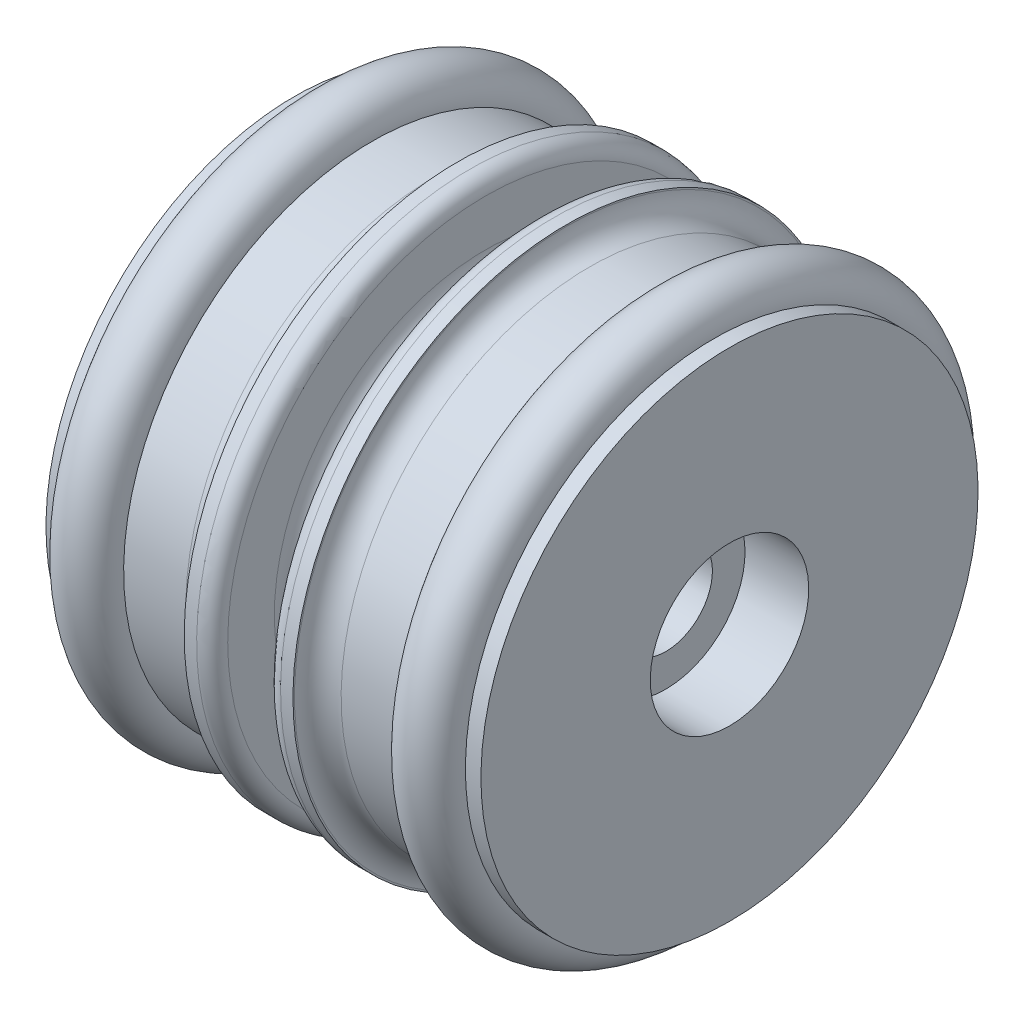
ISO-10303-21;
HEADER;
FILE_DESCRIPTION(('STEP AP214'),'2;1');
FILE_NAME('part.step','',(''),(''),'','','');
FILE_SCHEMA(('AUTOMOTIVE_DESIGN { 1 0 10303 214 1 1 1 1 }'));
ENDSEC;
DATA;
#1=APPLICATION_CONTEXT('core data for automotive mechanical design processes');
#2=APPLICATION_PROTOCOL_DEFINITION('international standard','automotive_design',2000,#1);
#3=PRODUCT_CONTEXT('',#1,'mechanical');
#4=PRODUCT('Part','Part','',(#3));
#5=PRODUCT_RELATED_PRODUCT_CATEGORY('part','',(#4));
#6=PRODUCT_DEFINITION_FORMATION('','',#4);
#7=PRODUCT_DEFINITION_CONTEXT('part definition',#1,'design');
#8=PRODUCT_DEFINITION('design','',#6,#7);
#9=PRODUCT_DEFINITION_SHAPE('','',#8);
#10=(LENGTH_UNIT() NAMED_UNIT(*) SI_UNIT(.MILLI.,.METRE.));
#11=(NAMED_UNIT(*) PLANE_ANGLE_UNIT() SI_UNIT($,.RADIAN.));
#12=(NAMED_UNIT(*) SI_UNIT($,.STERADIAN.) SOLID_ANGLE_UNIT());
#13=UNCERTAINTY_MEASURE_WITH_UNIT(LENGTH_MEASURE(1.E-05),#10,'distance_accuracy_value','');
#14=(GEOMETRIC_REPRESENTATION_CONTEXT(3) GLOBAL_UNCERTAINTY_ASSIGNED_CONTEXT((#13)) GLOBAL_UNIT_ASSIGNED_CONTEXT((#10,
#11,#12)) REPRESENTATION_CONTEXT('',''));
#15=CARTESIAN_POINT('',(0.,0.,0.));
#16=DIRECTION('',(0.,0.,1.));
#17=DIRECTION('',(1.,0.,0.));
#18=AXIS2_PLACEMENT_3D('',#15,#16,#17);
#19=CARTESIAN_POINT('',(25.3003912722596,0.,0.));
#20=DIRECTION('',(-1.,0.,0.));
#21=DIRECTION('',(0.,-1.,0.));
#22=AXIS2_PLACEMENT_3D('',#19,#20,#21);
#23=TOROIDAL_SURFACE('',#22,16.,1.95);
#24=CARTESIAN_POINT('',(25.3003912722596,-17.95,0.));
#25=VERTEX_POINT('',#24);
#26=VERTEX_LOOP('',#25);
#27=FACE_BOUND('',#26,.T.);
#28=ADVANCED_FACE('F40',(#27),#23,.T.);
#29=CLOSED_SHELL('',(#28));
#30=MANIFOLD_SOLID_BREP('B2',#29);
#31=CARTESIAN_POINT('',(3.30039127225962,0.,0.));
#32=DIRECTION('',(-1.,0.,0.));
#33=DIRECTION('',(0.,-1.,0.));
#34=AXIS2_PLACEMENT_3D('',#31,#32,#33);
#35=TOROIDAL_SURFACE('',#34,16.,1.95);
#36=CARTESIAN_POINT('',(3.30039127225962,-17.95,0.));
#37=VERTEX_POINT('',#36);
#38=VERTEX_LOOP('',#37);
#39=FACE_BOUND('',#38,.T.);
#40=ADVANCED_FACE('F62',(#39),#35,.T.);
#41=CLOSED_SHELL('',(#40));
#42=MANIFOLD_SOLID_BREP('B6',#41);
#43=CARTESIAN_POINT('',(4.40039127225962,5.1,0.));
#44=DIRECTION('',(1.,0.,0.));
#45=DIRECTION('',(0.,1.,0.));
#46=AXIS2_PLACEMENT_3D('',#43,#44,#45);
#47=PLANE('',#46);
#48=CARTESIAN_POINT('',(4.40039127225962,0.,0.));
#49=DIRECTION('',(-1.,0.,0.));
#50=DIRECTION('',(0.,-1.,0.));
#51=AXIS2_PLACEMENT_3D('',#48,#49,#50);
#52=CIRCLE('',#51,3.);
#53=CARTESIAN_POINT('',(4.40039127225962,-3.,0.));
#54=VERTEX_POINT('',#53);
#55=EDGE_CURVE('E61',#54,#54,#52,.T.);
#56=ORIENTED_EDGE('',*,*,#55,.F.);
#57=EDGE_LOOP('',(#56));
#58=FACE_BOUND('',#57,.T.);
#59=CARTESIAN_POINT('',(4.40039127225962,0.,0.));
#60=DIRECTION('',(-1.,0.,0.));
#61=DIRECTION('',(0.,-1.,0.));
#62=AXIS2_PLACEMENT_3D('',#59,#60,#61);
#63=CIRCLE('',#62,5.1);
#64=CARTESIAN_POINT('',(4.40039127225962,-5.1,0.));
#65=VERTEX_POINT('',#64);
#66=EDGE_CURVE('E159',#65,#65,#63,.T.);
#67=ORIENTED_EDGE('',*,*,#66,.T.);
#68=EDGE_LOOP('',(#67));
#69=FACE_BOUND('',#68,.T.);
#70=ADVANCED_FACE('F77',(#58,#69),#47,.F.);
#71=CARTESIAN_POINT('',(0.,0.,0.));
#72=DIRECTION('',(-1.,0.,0.));
#73=DIRECTION('',(0.,-1.,0.));
#74=AXIS2_PLACEMENT_3D('',#71,#72,#73);
#75=CYLINDRICAL_SURFACE('',#74,3.);
#76=CARTESIAN_POINT('',(24.2003912722596,0.,0.));
#77=DIRECTION('',(-1.,0.,0.));
#78=DIRECTION('',(0.,-1.,0.));
#79=AXIS2_PLACEMENT_3D('',#76,#77,#78);
#80=CIRCLE('',#79,3.);
#81=CARTESIAN_POINT('',(24.2003912722596,-3.,0.));
#82=VERTEX_POINT('',#81);
#83=EDGE_CURVE('E83',#82,#82,#80,.T.);
#84=ORIENTED_EDGE('',*,*,#83,.F.);
#85=EDGE_LOOP('',(#84));
#86=FACE_BOUND('',#85,.T.);
#87=ORIENTED_EDGE('',*,*,#55,.T.);
#88=EDGE_LOOP('',(#87));
#89=FACE_BOUND('',#88,.T.);
#90=ADVANCED_FACE('F304',(#86,#89),#75,.F.);
#91=CARTESIAN_POINT('',(24.2003912722596,3.,0.));
#92=DIRECTION('',(-1.,0.,0.));
#93=DIRECTION('',(0.,-1.,0.));
#94=AXIS2_PLACEMENT_3D('',#91,#92,#93);
#95=PLANE('',#94);
#96=CARTESIAN_POINT('',(24.2003912722596,0.,0.));
#97=DIRECTION('',(-1.,0.,0.));
#98=DIRECTION('',(0.,-1.,0.));
#99=AXIS2_PLACEMENT_3D('',#96,#97,#98);
#100=CIRCLE('',#99,5.1);
#101=CARTESIAN_POINT('',(24.2003912722596,-5.1,0.));
#102=VERTEX_POINT('',#101);
#103=EDGE_CURVE('E87',#102,#102,#100,.T.);
#104=ORIENTED_EDGE('',*,*,#103,.F.);
#105=EDGE_LOOP('',(#104));
#106=FACE_BOUND('',#105,.T.);
#107=ORIENTED_EDGE('',*,*,#83,.T.);
#108=EDGE_LOOP('',(#107));
#109=FACE_BOUND('',#108,.T.);
#110=ADVANCED_FACE('F299',(#106,#109),#95,.F.);
#111=CARTESIAN_POINT('',(0.,0.,0.));
#112=DIRECTION('',(-1.,0.,0.));
#113=DIRECTION('',(0.,-1.,0.));
#114=AXIS2_PLACEMENT_3D('',#111,#112,#113);
#115=CYLINDRICAL_SURFACE('',#114,5.1);
#116=CARTESIAN_POINT('',(28.3003912722596,0.,0.));
#117=DIRECTION('',(-1.,0.,0.));
#118=DIRECTION('',(0.,-1.,0.));
#119=AXIS2_PLACEMENT_3D('',#116,#117,#118);
#120=CIRCLE('',#119,5.1);
#121=CARTESIAN_POINT('',(28.3003912722596,-5.1,0.));
#122=VERTEX_POINT('',#121);
#123=EDGE_CURVE('E91',#122,#122,#120,.T.);
#124=ORIENTED_EDGE('',*,*,#123,.F.);
#125=EDGE_LOOP('',(#124));
#126=FACE_BOUND('',#125,.T.);
#127=ORIENTED_EDGE('',*,*,#103,.T.);
#128=EDGE_LOOP('',(#127));
#129=FACE_BOUND('',#128,.T.);
#130=ADVANCED_FACE('F293',(#126,#129),#115,.F.);
#131=CARTESIAN_POINT('',(28.3003912722596,16.,0.));
#132=DIRECTION('',(-1.,0.,0.));
#133=DIRECTION('',(0.,-1.,0.));
#134=AXIS2_PLACEMENT_3D('',#131,#132,#133);
#135=PLANE('',#134);
#136=CARTESIAN_POINT('',(28.3003912722596,0.,0.));
#137=DIRECTION('',(-1.,0.,0.));
#138=DIRECTION('',(0.,-1.,0.));
#139=AXIS2_PLACEMENT_3D('',#136,#137,#138);
#140=CIRCLE('',#139,16.);
#141=CARTESIAN_POINT('',(28.3003912722596,-16.,0.));
#142=VERTEX_POINT('',#141);
#143=EDGE_CURVE('E96',#142,#142,#140,.T.);
#144=ORIENTED_EDGE('',*,*,#143,.F.);
#145=EDGE_LOOP('',(#144));
#146=FACE_BOUND('',#145,.T.);
#147=ORIENTED_EDGE('',*,*,#123,.T.);
#148=EDGE_LOOP('',(#147));
#149=FACE_BOUND('',#148,.T.);
#150=ADVANCED_FACE('F287',(#146,#149),#135,.F.);
#151=CARTESIAN_POINT('',(0.,0.,0.));
#152=DIRECTION('',(-1.,0.,0.));
#153=DIRECTION('',(0.,-1.,0.));
#154=AXIS2_PLACEMENT_3D('',#151,#152,#153);
#155=CYLINDRICAL_SURFACE('',#154,16.);
#156=CARTESIAN_POINT('',(27.3003912722596,0.,0.));
#157=DIRECTION('',(-1.,0.,0.));
#158=DIRECTION('',(0.,-1.,0.));
#159=AXIS2_PLACEMENT_3D('',#156,#157,#158);
#160=CIRCLE('',#159,16.);
#161=CARTESIAN_POINT('',(27.3003912722596,-16.,0.));
#162=VERTEX_POINT('',#161);
#163=EDGE_CURVE('E99',#162,#162,#160,.T.);
#164=ORIENTED_EDGE('',*,*,#163,.F.);
#165=EDGE_LOOP('',(#164));
#166=FACE_BOUND('',#165,.T.);
#167=ORIENTED_EDGE('',*,*,#143,.T.);
#168=EDGE_LOOP('',(#167));
#169=FACE_BOUND('',#168,.T.);
#170=ADVANCED_FACE('F281',(#166,#169),#155,.T.);
#171=CARTESIAN_POINT('',(25.3003912722596,0.,0.));
#172=DIRECTION('',(-1.,0.,0.));
#173=DIRECTION('',(0.,-1.,0.));
#174=AXIS2_PLACEMENT_3D('',#171,#172,#173);
#175=TOROIDAL_SURFACE('',#174,16.,2.);
#176=CARTESIAN_POINT('',(23.3003912722596,0.,0.));
#177=DIRECTION('',(-1.,0.,0.));
#178=DIRECTION('',(0.,-1.,0.));
#179=AXIS2_PLACEMENT_3D('',#176,#177,#178);
#180=CIRCLE('',#179,16.);
#181=CARTESIAN_POINT('',(23.3003912722596,-16.,0.));
#182=VERTEX_POINT('',#181);
#183=EDGE_CURVE('E102',#182,#182,#180,.T.);
#184=ORIENTED_EDGE('',*,*,#183,.F.);
#185=EDGE_LOOP('',(#184));
#186=FACE_BOUND('',#185,.T.);
#187=ORIENTED_EDGE('',*,*,#163,.T.);
#188=EDGE_LOOP('',(#187));
#189=FACE_BOUND('',#188,.T.);
#190=ADVANCED_FACE('F275',(#186,#189),#175,.F.);
#191=CARTESIAN_POINT('',(0.,0.,0.));
#192=DIRECTION('',(-1.,0.,0.));
#193=DIRECTION('',(0.,-1.,0.));
#194=AXIS2_PLACEMENT_3D('',#191,#192,#193);
#195=CYLINDRICAL_SURFACE('',#194,16.);
#196=CARTESIAN_POINT('',(19.3003912722596,0.,0.));
#197=DIRECTION('',(-1.,0.,0.));
#198=DIRECTION('',(0.,-1.,0.));
#199=AXIS2_PLACEMENT_3D('',#196,#197,#198);
#200=CIRCLE('',#199,16.);
#201=CARTESIAN_POINT('',(19.3003912722596,-16.,0.));
#202=VERTEX_POINT('',#201);
#203=EDGE_CURVE('E105',#202,#202,#200,.T.);
#204=ORIENTED_EDGE('',*,*,#203,.F.);
#205=EDGE_LOOP('',(#204));
#206=FACE_BOUND('',#205,.T.);
#207=ORIENTED_EDGE('',*,*,#183,.T.);
#208=EDGE_LOOP('',(#207));
#209=FACE_BOUND('',#208,.T.);
#210=ADVANCED_FACE('F269',(#206,#209),#195,.T.);
#211=CARTESIAN_POINT('',(19.3003912722596,0.,0.));
#212=DIRECTION('',(-1.,0.,0.));
#213=DIRECTION('',(0.,-1.,0.));
#214=AXIS2_PLACEMENT_3D('',#211,#212,#213);
#215=TOROIDAL_SURFACE('',#214,17.5,1.5);
#216=CARTESIAN_POINT('',(17.8003912722596,0.,0.));
#217=DIRECTION('',(-1.,0.,0.));
#218=DIRECTION('',(0.,-1.,0.));
#219=AXIS2_PLACEMENT_3D('',#216,#217,#218);
#220=CIRCLE('',#219,17.5);
#221=CARTESIAN_POINT('',(17.8003912722596,-17.5,0.));
#222=VERTEX_POINT('',#221);
#223=EDGE_CURVE('E108',#222,#222,#220,.T.);
#224=ORIENTED_EDGE('',*,*,#223,.F.);
#225=EDGE_LOOP('',(#224));
#226=FACE_BOUND('',#225,.T.);
#227=ORIENTED_EDGE('',*,*,#203,.T.);
#228=EDGE_LOOP('',(#227));
#229=FACE_BOUND('',#228,.T.);
#230=ADVANCED_FACE('F263',(#226,#229),#215,.F.);
#231=CARTESIAN_POINT('',(17.8003912722596,17.5,0.));
#232=DIRECTION('',(-1.,0.,0.));
#233=DIRECTION('',(0.,-1.,0.));
#234=AXIS2_PLACEMENT_3D('',#231,#232,#233);
#235=PLANE('',#234);
#236=CARTESIAN_POINT('',(17.8003912722596,0.,0.));
#237=DIRECTION('',(-1.,0.,0.));
#238=DIRECTION('',(0.,-1.,0.));
#239=AXIS2_PLACEMENT_3D('',#236,#237,#238);
#240=CIRCLE('',#239,17.6);
#241=CARTESIAN_POINT('',(17.8003912722596,-17.6,0.));
#242=VERTEX_POINT('',#241);
#243=EDGE_CURVE('E111',#242,#242,#240,.T.);
#244=ORIENTED_EDGE('',*,*,#243,.F.);
#245=EDGE_LOOP('',(#244));
#246=FACE_BOUND('',#245,.T.);
#247=ORIENTED_EDGE('',*,*,#223,.T.);
#248=EDGE_LOOP('',(#247));
#249=FACE_BOUND('',#248,.T.);
#250=ADVANCED_FACE('F257',(#246,#249),#235,.F.);
#251=CARTESIAN_POINT('',(0.,0.,0.));
#252=DIRECTION('',(-1.,0.,0.));
#253=DIRECTION('',(0.,-1.,0.));
#254=AXIS2_PLACEMENT_3D('',#251,#252,#253);
#255=CYLINDRICAL_SURFACE('',#254,17.6);
#256=CARTESIAN_POINT('',(17.0003912722596,0.,0.));
#257=DIRECTION('',(-1.,0.,0.));
#258=DIRECTION('',(0.,-1.,0.));
#259=AXIS2_PLACEMENT_3D('',#256,#257,#258);
#260=CIRCLE('',#259,17.6);
#261=CARTESIAN_POINT('',(17.0003912722596,-17.6,0.));
#262=VERTEX_POINT('',#261);
#263=EDGE_CURVE('E114',#262,#262,#260,.T.);
#264=ORIENTED_EDGE('',*,*,#263,.F.);
#265=EDGE_LOOP('',(#264));
#266=FACE_BOUND('',#265,.T.);
#267=ORIENTED_EDGE('',*,*,#243,.T.);
#268=EDGE_LOOP('',(#267));
#269=FACE_BOUND('',#268,.T.);
#270=ADVANCED_FACE('F251',(#266,#269),#255,.T.);
#271=CARTESIAN_POINT('',(17.0003912722596,0.,0.));
#272=DIRECTION('',(-1.,0.,0.));
#273=DIRECTION('',(0.,-1.,0.));
#274=AXIS2_PLACEMENT_3D('',#271,#272,#273);
#275=TOROIDAL_SURFACE('',#274,16.6,1.);
#276=CARTESIAN_POINT('',(16.0003912722596,0.,0.));
#277=DIRECTION('',(-1.,0.,0.));
#278=DIRECTION('',(0.,-1.,0.));
#279=AXIS2_PLACEMENT_3D('',#276,#277,#278);
#280=CIRCLE('',#279,16.6);
#281=CARTESIAN_POINT('',(16.0003912722596,-16.6,0.));
#282=VERTEX_POINT('',#281);
#283=EDGE_CURVE('E117',#282,#282,#280,.T.);
#284=ORIENTED_EDGE('',*,*,#283,.F.);
#285=EDGE_LOOP('',(#284));
#286=FACE_BOUND('',#285,.T.);
#287=ORIENTED_EDGE('',*,*,#263,.T.);
#288=EDGE_LOOP('',(#287));
#289=FACE_BOUND('',#288,.T.);
#290=ADVANCED_FACE('F245',(#286,#289),#275,.T.);
#291=CARTESIAN_POINT('',(16.0003912722596,13.6,0.));
#292=DIRECTION('',(1.,0.,0.));
#293=DIRECTION('',(0.,1.,0.));
#294=AXIS2_PLACEMENT_3D('',#291,#292,#293);
#295=PLANE('',#294);
#296=CARTESIAN_POINT('',(16.0003912722596,0.,0.));
#297=DIRECTION('',(-1.,0.,0.));
#298=DIRECTION('',(0.,-1.,0.));
#299=AXIS2_PLACEMENT_3D('',#296,#297,#298);
#300=CIRCLE('',#299,13.6);
#301=CARTESIAN_POINT('',(16.0003912722596,-13.6,0.));
#302=VERTEX_POINT('',#301);
#303=EDGE_CURVE('E120',#302,#302,#300,.T.);
#304=ORIENTED_EDGE('',*,*,#303,.F.);
#305=EDGE_LOOP('',(#304));
#306=FACE_BOUND('',#305,.T.);
#307=ORIENTED_EDGE('',*,*,#283,.T.);
#308=EDGE_LOOP('',(#307));
#309=FACE_BOUND('',#308,.T.);
#310=ADVANCED_FACE('F239',(#306,#309),#295,.F.);
#311=CARTESIAN_POINT('',(14.5003912722596,0.,0.));
#312=DIRECTION('',(-1.,0.,0.));
#313=DIRECTION('',(0.,-1.,0.));
#314=AXIS2_PLACEMENT_3D('',#311,#312,#313);
#315=TOROIDAL_SURFACE('',#314,13.6,1.5);
#316=CARTESIAN_POINT('',(14.5003912722596,0.,0.));
#317=DIRECTION('',(-1.,0.,0.));
#318=DIRECTION('',(0.,-1.,0.));
#319=AXIS2_PLACEMENT_3D('',#316,#317,#318);
#320=CIRCLE('',#319,12.1);
#321=CARTESIAN_POINT('',(14.5003912722596,-12.1,0.));
#322=VERTEX_POINT('',#321);
#323=EDGE_CURVE('E123',#322,#322,#320,.T.);
#324=ORIENTED_EDGE('',*,*,#323,.F.);
#325=EDGE_LOOP('',(#324));
#326=FACE_BOUND('',#325,.T.);
#327=ORIENTED_EDGE('',*,*,#303,.T.);
#328=EDGE_LOOP('',(#327));
#329=FACE_BOUND('',#328,.T.);
#330=ADVANCED_FACE('F233',(#326,#329),#315,.F.);
#331=CARTESIAN_POINT('',(0.,0.,0.));
#332=DIRECTION('',(-1.,0.,0.));
#333=DIRECTION('',(0.,-1.,0.));
#334=AXIS2_PLACEMENT_3D('',#331,#332,#333);
#335=CYLINDRICAL_SURFACE('',#334,12.1);
#336=CARTESIAN_POINT('',(14.1003912722596,0.,0.));
#337=DIRECTION('',(-1.,0.,0.));
#338=DIRECTION('',(0.,-1.,0.));
#339=AXIS2_PLACEMENT_3D('',#336,#337,#338);
#340=CIRCLE('',#339,12.1);
#341=CARTESIAN_POINT('',(14.1003912722596,-12.1,0.));
#342=VERTEX_POINT('',#341);
#343=EDGE_CURVE('E126',#342,#342,#340,.T.);
#344=ORIENTED_EDGE('',*,*,#343,.F.);
#345=EDGE_LOOP('',(#344));
#346=FACE_BOUND('',#345,.T.);
#347=ORIENTED_EDGE('',*,*,#323,.T.);
#348=EDGE_LOOP('',(#347));
#349=FACE_BOUND('',#348,.T.);
#350=ADVANCED_FACE('F227',(#346,#349),#335,.T.);
#351=CARTESIAN_POINT('',(14.1003912722596,0.,0.));
#352=DIRECTION('',(-1.,0.,0.));
#353=DIRECTION('',(0.,-1.,0.));
#354=AXIS2_PLACEMENT_3D('',#351,#352,#353);
#355=TOROIDAL_SURFACE('',#354,13.6,1.5);
#356=CARTESIAN_POINT('',(12.6003912722596,0.,0.));
#357=DIRECTION('',(-1.,0.,0.));
#358=DIRECTION('',(0.,-1.,0.));
#359=AXIS2_PLACEMENT_3D('',#356,#357,#358);
#360=CIRCLE('',#359,13.6);
#361=CARTESIAN_POINT('',(12.6003912722596,-13.6,0.));
#362=VERTEX_POINT('',#361);
#363=EDGE_CURVE('E129',#362,#362,#360,.T.);
#364=ORIENTED_EDGE('',*,*,#363,.F.);
#365=EDGE_LOOP('',(#364));
#366=FACE_BOUND('',#365,.T.);
#367=ORIENTED_EDGE('',*,*,#343,.T.);
#368=EDGE_LOOP('',(#367));
#369=FACE_BOUND('',#368,.T.);
#370=ADVANCED_FACE('F221',(#366,#369),#355,.F.);
#371=CARTESIAN_POINT('',(12.6003912722596,13.6,0.));
#372=DIRECTION('',(-1.,0.,0.));
#373=DIRECTION('',(0.,-1.,0.));
#374=AXIS2_PLACEMENT_3D('',#371,#372,#373);
#375=PLANE('',#374);
#376=CARTESIAN_POINT('',(12.6003912722596,0.,0.));
#377=DIRECTION('',(-1.,0.,0.));
#378=DIRECTION('',(0.,-1.,0.));
#379=AXIS2_PLACEMENT_3D('',#376,#377,#378);
#380=CIRCLE('',#379,16.6);
#381=CARTESIAN_POINT('',(12.6003912722596,-16.6,0.));
#382=VERTEX_POINT('',#381);
#383=EDGE_CURVE('E132',#382,#382,#380,.T.);
#384=ORIENTED_EDGE('',*,*,#383,.F.);
#385=EDGE_LOOP('',(#384));
#386=FACE_BOUND('',#385,.T.);
#387=ORIENTED_EDGE('',*,*,#363,.T.);
#388=EDGE_LOOP('',(#387));
#389=FACE_BOUND('',#388,.T.);
#390=ADVANCED_FACE('F215',(#386,#389),#375,.F.);
#391=CARTESIAN_POINT('',(11.6003912722596,0.,0.));
#392=DIRECTION('',(-1.,0.,0.));
#393=DIRECTION('',(0.,-1.,0.));
#394=AXIS2_PLACEMENT_3D('',#391,#392,#393);
#395=TOROIDAL_SURFACE('',#394,16.6,1.);
#396=CARTESIAN_POINT('',(11.6003912722596,0.,0.));
#397=DIRECTION('',(-1.,0.,0.));
#398=DIRECTION('',(0.,-1.,0.));
#399=AXIS2_PLACEMENT_3D('',#396,#397,#398);
#400=CIRCLE('',#399,17.6);
#401=CARTESIAN_POINT('',(11.6003912722596,-17.6,0.));
#402=VERTEX_POINT('',#401);
#403=EDGE_CURVE('E135',#402,#402,#400,.T.);
#404=ORIENTED_EDGE('',*,*,#403,.F.);
#405=EDGE_LOOP('',(#404));
#406=FACE_BOUND('',#405,.T.);
#407=ORIENTED_EDGE('',*,*,#383,.T.);
#408=EDGE_LOOP('',(#407));
#409=FACE_BOUND('',#408,.T.);
#410=ADVANCED_FACE('F209',(#406,#409),#395,.T.);
#411=CARTESIAN_POINT('',(0.,0.,0.));
#412=DIRECTION('',(-1.,0.,0.));
#413=DIRECTION('',(0.,-1.,0.));
#414=AXIS2_PLACEMENT_3D('',#411,#412,#413);
#415=CYLINDRICAL_SURFACE('',#414,17.6);
#416=CARTESIAN_POINT('',(10.8003912722596,0.,0.));
#417=DIRECTION('',(-1.,0.,0.));
#418=DIRECTION('',(0.,-1.,0.));
#419=AXIS2_PLACEMENT_3D('',#416,#417,#418);
#420=CIRCLE('',#419,17.6);
#421=CARTESIAN_POINT('',(10.8003912722596,-17.6,0.));
#422=VERTEX_POINT('',#421);
#423=EDGE_CURVE('E138',#422,#422,#420,.T.);
#424=ORIENTED_EDGE('',*,*,#423,.F.);
#425=EDGE_LOOP('',(#424));
#426=FACE_BOUND('',#425,.T.);
#427=ORIENTED_EDGE('',*,*,#403,.T.);
#428=EDGE_LOOP('',(#427));
#429=FACE_BOUND('',#428,.T.);
#430=ADVANCED_FACE('F203',(#426,#429),#415,.T.);
#431=CARTESIAN_POINT('',(10.8003912722596,17.6,0.));
#432=DIRECTION('',(1.,0.,0.));
#433=DIRECTION('',(0.,1.,0.));
#434=AXIS2_PLACEMENT_3D('',#431,#432,#433);
#435=PLANE('',#434);
#436=CARTESIAN_POINT('',(10.8003912722596,0.,0.));
#437=DIRECTION('',(-1.,0.,0.));
#438=DIRECTION('',(0.,-1.,0.));
#439=AXIS2_PLACEMENT_3D('',#436,#437,#438);
#440=CIRCLE('',#439,17.5);
#441=CARTESIAN_POINT('',(10.8003912722596,-17.5,0.));
#442=VERTEX_POINT('',#441);
#443=EDGE_CURVE('E141',#442,#442,#440,.T.);
#444=ORIENTED_EDGE('',*,*,#443,.F.);
#445=EDGE_LOOP('',(#444));
#446=FACE_BOUND('',#445,.T.);
#447=ORIENTED_EDGE('',*,*,#423,.T.);
#448=EDGE_LOOP('',(#447));
#449=FACE_BOUND('',#448,.T.);
#450=ADVANCED_FACE('F197',(#446,#449),#435,.F.);
#451=CARTESIAN_POINT('',(9.30039127225962,0.,0.));
#452=DIRECTION('',(-1.,0.,0.));
#453=DIRECTION('',(0.,-1.,0.));
#454=AXIS2_PLACEMENT_3D('',#451,#452,#453);
#455=TOROIDAL_SURFACE('',#454,17.5,1.5);
#456=CARTESIAN_POINT('',(9.30039127225962,0.,0.));
#457=DIRECTION('',(-1.,0.,0.));
#458=DIRECTION('',(0.,-1.,0.));
#459=AXIS2_PLACEMENT_3D('',#456,#457,#458);
#460=CIRCLE('',#459,16.);
#461=CARTESIAN_POINT('',(9.30039127225962,-16.,0.));
#462=VERTEX_POINT('',#461);
#463=EDGE_CURVE('E144',#462,#462,#460,.T.);
#464=ORIENTED_EDGE('',*,*,#463,.F.);
#465=EDGE_LOOP('',(#464));
#466=FACE_BOUND('',#465,.T.);
#467=ORIENTED_EDGE('',*,*,#443,.T.);
#468=EDGE_LOOP('',(#467));
#469=FACE_BOUND('',#468,.T.);
#470=ADVANCED_FACE('F191',(#466,#469),#455,.F.);
#471=CARTESIAN_POINT('',(0.,0.,0.));
#472=DIRECTION('',(-1.,0.,0.));
#473=DIRECTION('',(0.,-1.,0.));
#474=AXIS2_PLACEMENT_3D('',#471,#472,#473);
#475=CYLINDRICAL_SURFACE('',#474,16.);
#476=CARTESIAN_POINT('',(5.30039127225962,0.,0.));
#477=DIRECTION('',(-1.,0.,0.));
#478=DIRECTION('',(0.,-1.,0.));
#479=AXIS2_PLACEMENT_3D('',#476,#477,#478);
#480=CIRCLE('',#479,16.);
#481=CARTESIAN_POINT('',(5.30039127225962,-16.,0.));
#482=VERTEX_POINT('',#481);
#483=EDGE_CURVE('E147',#482,#482,#480,.T.);
#484=ORIENTED_EDGE('',*,*,#483,.F.);
#485=EDGE_LOOP('',(#484));
#486=FACE_BOUND('',#485,.T.);
#487=ORIENTED_EDGE('',*,*,#463,.T.);
#488=EDGE_LOOP('',(#487));
#489=FACE_BOUND('',#488,.T.);
#490=ADVANCED_FACE('F185',(#486,#489),#475,.T.);
#491=CARTESIAN_POINT('',(3.30039127225962,0.,0.));
#492=DIRECTION('',(-1.,0.,0.));
#493=DIRECTION('',(0.,-1.,0.));
#494=AXIS2_PLACEMENT_3D('',#491,#492,#493);
#495=TOROIDAL_SURFACE('',#494,16.,2.);
#496=CARTESIAN_POINT('',(1.30039127225962,0.,0.));
#497=DIRECTION('',(-1.,0.,0.));
#498=DIRECTION('',(0.,-1.,0.));
#499=AXIS2_PLACEMENT_3D('',#496,#497,#498);
#500=CIRCLE('',#499,16.);
#501=CARTESIAN_POINT('',(1.30039127225962,-16.,0.));
#502=VERTEX_POINT('',#501);
#503=EDGE_CURVE('E150',#502,#502,#500,.T.);
#504=ORIENTED_EDGE('',*,*,#503,.F.);
#505=EDGE_LOOP('',(#504));
#506=FACE_BOUND('',#505,.T.);
#507=ORIENTED_EDGE('',*,*,#483,.T.);
#508=EDGE_LOOP('',(#507));
#509=FACE_BOUND('',#508,.T.);
#510=ADVANCED_FACE('F179',(#506,#509),#495,.F.);
#511=CARTESIAN_POINT('',(0.,0.,0.));
#512=DIRECTION('',(-1.,0.,0.));
#513=DIRECTION('',(0.,-1.,0.));
#514=AXIS2_PLACEMENT_3D('',#511,#512,#513);
#515=CYLINDRICAL_SURFACE('',#514,16.);
#516=CARTESIAN_POINT('',(0.300391272259617,0.,0.));
#517=DIRECTION('',(-1.,0.,0.));
#518=DIRECTION('',(0.,-1.,0.));
#519=AXIS2_PLACEMENT_3D('',#516,#517,#518);
#520=CIRCLE('',#519,16.);
#521=CARTESIAN_POINT('',(0.300391272259617,-16.,0.));
#522=VERTEX_POINT('',#521);
#523=EDGE_CURVE('E153',#522,#522,#520,.T.);
#524=ORIENTED_EDGE('',*,*,#523,.F.);
#525=EDGE_LOOP('',(#524));
#526=FACE_BOUND('',#525,.T.);
#527=ORIENTED_EDGE('',*,*,#503,.T.);
#528=EDGE_LOOP('',(#527));
#529=FACE_BOUND('',#528,.T.);
#530=ADVANCED_FACE('F173',(#526,#529),#515,.T.);
#531=CARTESIAN_POINT('',(0.300391272259618,16.,0.));
#532=DIRECTION('',(1.,0.,0.));
#533=DIRECTION('',(0.,1.,0.));
#534=AXIS2_PLACEMENT_3D('',#531,#532,#533);
#535=PLANE('',#534);
#536=CARTESIAN_POINT('',(0.300391272259618,0.,0.));
#537=DIRECTION('',(-1.,0.,0.));
#538=DIRECTION('',(0.,-1.,0.));
#539=AXIS2_PLACEMENT_3D('',#536,#537,#538);
#540=CIRCLE('',#539,5.1);
#541=CARTESIAN_POINT('',(0.300391272259618,-5.1,0.));
#542=VERTEX_POINT('',#541);
#543=EDGE_CURVE('E156',#542,#542,#540,.T.);
#544=ORIENTED_EDGE('',*,*,#543,.F.);
#545=EDGE_LOOP('',(#544));
#546=FACE_BOUND('',#545,.T.);
#547=ORIENTED_EDGE('',*,*,#523,.T.);
#548=EDGE_LOOP('',(#547));
#549=FACE_BOUND('',#548,.T.);
#550=ADVANCED_FACE('F167',(#546,#549),#535,.F.);
#551=CARTESIAN_POINT('',(0.,0.,0.));
#552=DIRECTION('',(-1.,0.,0.));
#553=DIRECTION('',(0.,-1.,0.));
#554=AXIS2_PLACEMENT_3D('',#551,#552,#553);
#555=CYLINDRICAL_SURFACE('',#554,5.1);
#556=ORIENTED_EDGE('',*,*,#66,.F.);
#557=EDGE_LOOP('',(#556));
#558=FACE_BOUND('',#557,.T.);
#559=ORIENTED_EDGE('',*,*,#543,.T.);
#560=EDGE_LOOP('',(#559));
#561=FACE_BOUND('',#560,.T.);
#562=ADVANCED_FACE('F164',(#558,#561),#555,.F.);
#563=CLOSED_SHELL('',(#70,#90,#110,#130,#150,#170,#190,#210,#230,#250,#270,#290,#310,#330,#350,
#370,#390,#410,#430,#450,#470,#490,#510,#530,#550,#562));
#564=MANIFOLD_SOLID_BREP('B36',#563);
#565=ADVANCED_BREP_SHAPE_REPRESENTATION('',(#18,#30,#42,#564),#14);
#566=SHAPE_DEFINITION_REPRESENTATION(#9,#565);
ENDSEC;
END-ISO-10303-21;
